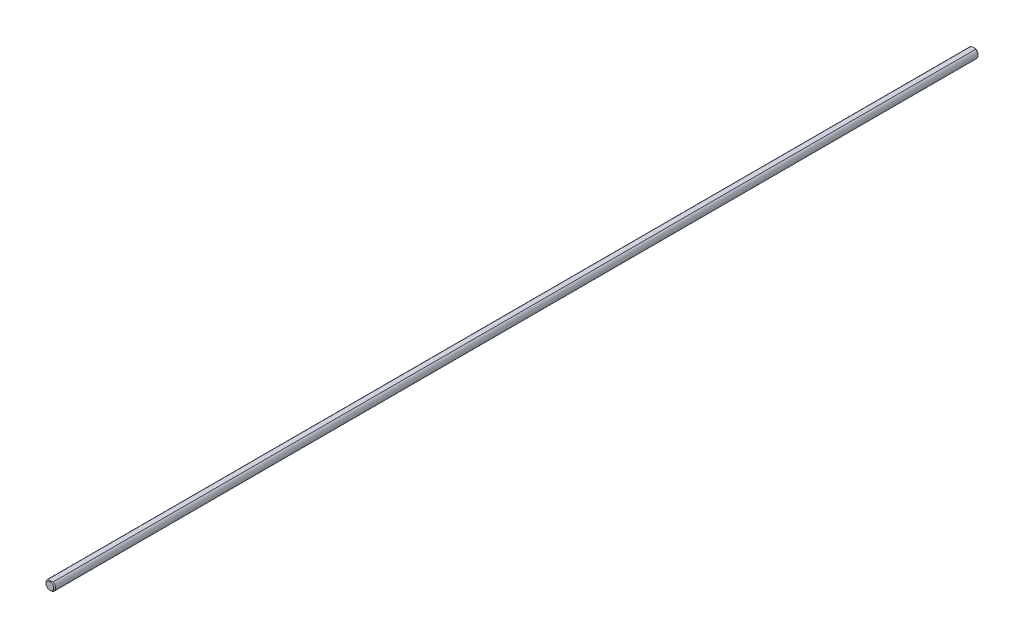
ISO-10303-21;
HEADER;
FILE_DESCRIPTION(('STEP AP214'),'2;1');
FILE_NAME('part.step','',(''),(''),'','','');
FILE_SCHEMA(('AUTOMOTIVE_DESIGN { 1 0 10303 214 1 1 1 1 }'));
ENDSEC;
DATA;
#1=APPLICATION_CONTEXT('core data for automotive mechanical design processes');
#2=APPLICATION_PROTOCOL_DEFINITION('international standard','automotive_design',2000,#1);
#3=PRODUCT_CONTEXT('',#1,'mechanical');
#4=PRODUCT('Part','Part','',(#3));
#5=PRODUCT_RELATED_PRODUCT_CATEGORY('part','',(#4));
#6=PRODUCT_DEFINITION_FORMATION('','',#4);
#7=PRODUCT_DEFINITION_CONTEXT('part definition',#1,'design');
#8=PRODUCT_DEFINITION('design','',#6,#7);
#9=PRODUCT_DEFINITION_SHAPE('','',#8);
#10=(LENGTH_UNIT() NAMED_UNIT(*) SI_UNIT(.MILLI.,.METRE.));
#11=(NAMED_UNIT(*) PLANE_ANGLE_UNIT() SI_UNIT($,.RADIAN.));
#12=(NAMED_UNIT(*) SI_UNIT($,.STERADIAN.) SOLID_ANGLE_UNIT());
#13=UNCERTAINTY_MEASURE_WITH_UNIT(LENGTH_MEASURE(1.E-05),#10,'distance_accuracy_value','');
#14=(GEOMETRIC_REPRESENTATION_CONTEXT(3) GLOBAL_UNCERTAINTY_ASSIGNED_CONTEXT((#13)) GLOBAL_UNIT_ASSIGNED_CONTEXT((#10,
#11,#12)) REPRESENTATION_CONTEXT('',''));
#15=CARTESIAN_POINT('',(0.,0.,0.));
#16=DIRECTION('',(0.,0.,1.));
#17=DIRECTION('',(1.,0.,0.));
#18=AXIS2_PLACEMENT_3D('',#15,#16,#17);
#19=CARTESIAN_POINT('',(0.,0.,304.8));
#20=DIRECTION('',(0.,0.,-1.));
#21=DIRECTION('',(-1.,0.,0.));
#22=AXIS2_PLACEMENT_3D('',#19,#20,#21);
#23=CYLINDRICAL_SURFACE('',#22,3.175);
#24=CARTESIAN_POINT('',(0.,0.,304.165));
#25=DIRECTION('',(0.,0.,1.));
#26=DIRECTION('',(1.,0.,0.));
#27=AXIS2_PLACEMENT_3D('',#24,#25,#26);
#28=CIRCLE('',#27,3.175);
#29=CARTESIAN_POINT('',(1.5875,2.74963065701559,304.165));
#30=VERTEX_POINT('',#29);
#31=CARTESIAN_POINT('',(-1.5875,2.74963065701559,304.165));
#32=VERTEX_POINT('',#31);
#33=EDGE_CURVE('E72',#30,#32,#28,.F.);
#34=ORIENTED_EDGE('',*,*,#33,.T.);
#35=DIRECTION('',(0.,0.,1.));
#36=VECTOR('',#35,1.);
#37=CARTESIAN_POINT('',(-1.5875,2.74963065701559,-304.8));
#38=LINE('',#37,#36);
#39=CARTESIAN_POINT('',(-1.5875,2.74963065701559,-304.164999999999));
#40=VERTEX_POINT('',#39);
#41=EDGE_CURVE('E50',#40,#32,#38,.T.);
#42=ORIENTED_EDGE('',*,*,#41,.F.);
#43=CARTESIAN_POINT('',(0.,0.,-304.164999999999));
#44=DIRECTION('',(0.,0.,1.));
#45=DIRECTION('',(1.,0.,0.));
#46=AXIS2_PLACEMENT_3D('',#43,#44,#45);
#47=CIRCLE('',#46,3.175);
#48=CARTESIAN_POINT('',(1.5875,2.74963065701559,-304.164999999999));
#49=VERTEX_POINT('',#48);
#50=EDGE_CURVE('E71',#40,#49,#47,.T.);
#51=ORIENTED_EDGE('',*,*,#50,.T.);
#52=DIRECTION('',(0.,0.,1.));
#53=VECTOR('',#52,1.);
#54=CARTESIAN_POINT('',(1.5875,2.74963065701559,-304.8));
#55=LINE('',#54,#53);
#56=EDGE_CURVE('E60',#49,#30,#55,.T.);
#57=ORIENTED_EDGE('',*,*,#56,.T.);
#58=EDGE_LOOP('',(#34,#42,#51,#57));
#59=FACE_BOUND('',#58,.T.);
#60=ADVANCED_FACE('F31',(#59),#23,.T.);
#61=CARTESIAN_POINT('',(0.,0.,304.8));
#62=DIRECTION('',(0.,0.,1.));
#63=DIRECTION('',(1.,0.,0.));
#64=AXIS2_PLACEMENT_3D('',#61,#62,#63);
#65=PLANE('',#64);
#66=CARTESIAN_POINT('',(0.,0.,304.8));
#67=DIRECTION('',(0.,0.,1.));
#68=DIRECTION('',(1.,0.,0.));
#69=AXIS2_PLACEMENT_3D('',#66,#67,#68);
#70=CIRCLE('',#69,2.54000000000021);
#71=CARTESIAN_POINT('',(2.54000000000021,0.,304.8));
#72=VERTEX_POINT('',#71);
#73=EDGE_CURVE('E44',#72,#72,#70,.T.);
#74=ORIENTED_EDGE('',*,*,#73,.T.);
#75=EDGE_LOOP('',(#74));
#76=FACE_BOUND('',#75,.T.);
#77=ADVANCED_FACE('F82',(#76),#65,.T.);
#78=CARTESIAN_POINT('',(0.,0.,-304.8));
#79=DIRECTION('',(0.,0.,1.));
#80=DIRECTION('',(1.,0.,0.));
#81=AXIS2_PLACEMENT_3D('',#78,#79,#80);
#82=PLANE('',#81);
#83=CARTESIAN_POINT('',(0.,0.,-304.8));
#84=DIRECTION('',(0.,0.,1.));
#85=DIRECTION('',(1.,0.,0.));
#86=AXIS2_PLACEMENT_3D('',#83,#84,#85);
#87=CIRCLE('',#86,2.53999999999938);
#88=CARTESIAN_POINT('',(2.53999999999938,0.,-304.8));
#89=VERTEX_POINT('',#88);
#90=EDGE_CURVE('E74',#89,#89,#87,.F.);
#91=ORIENTED_EDGE('',*,*,#90,.T.);
#92=EDGE_LOOP('',(#91));
#93=FACE_BOUND('',#92,.T.);
#94=ADVANCED_FACE('F90',(#93),#82,.F.);
#95=CARTESIAN_POINT('',(0.,0.,-304.164999999999));
#96=DIRECTION('',(0.,0.,1.));
#97=DIRECTION('',(1.,0.,0.));
#98=AXIS2_PLACEMENT_3D('',#95,#96,#97);
#99=CONICAL_SURFACE('',#98,3.175,0.785398163397463);
#100=CARTESIAN_POINT('',(-3.22896135223709,2.74963065701559,-303.098931718983));
#101=CARTESIAN_POINT('',(-3.15061649550086,2.74963065701559,-303.158566524546));
#102=CARTESIAN_POINT('',(-3.07184009651245,2.74963065701559,-303.217643482025));
#103=CARTESIAN_POINT('',(-2.91325130568802,2.74963065701559,-303.334429717618));
#104=CARTESIAN_POINT('',(-2.83343866506278,2.74963065701559,-303.392138657525));
#105=CARTESIAN_POINT('',(-2.6720206285273,2.74963065701559,-303.506347547805));
#106=CARTESIAN_POINT('',(-2.59040613970413,2.74963065701559,-303.562834689537));
#107=CARTESIAN_POINT('',(-2.42580311622148,2.74963065701559,-303.673763514334));
#108=CARTESIAN_POINT('',(-2.34281467809318,2.74963065701559,-303.728205340228));
#109=CARTESIAN_POINT('',(-2.17021447787212,2.74963065701559,-303.837773871165));
#110=CARTESIAN_POINT('',(-2.08050398524177,2.74963065701559,-303.89274583534));
#111=CARTESIAN_POINT('',(-1.89900904678676,2.74963065701559,-303.999146993197));
#112=CARTESIAN_POINT('',(-1.80722487525619,2.74963065701559,-304.050576651834));
#113=CARTESIAN_POINT('',(-1.62153760368914,2.74963065701559,-304.148814805051));
#114=CARTESIAN_POINT('',(-1.52764140922479,2.74963065701559,-304.195636250176));
#115=CARTESIAN_POINT('',(-1.33724706572087,2.74963065701559,-304.28360081534));
#116=CARTESIAN_POINT('',(-1.24075014112695,2.74963065701559,-304.324746553594));
#117=CARTESIAN_POINT('',(-1.05364742760737,2.74963065701559,-304.39655643723));
#118=CARTESIAN_POINT('',(-0.963276425588533,2.74963065701559,-304.427826043973));
#119=CARTESIAN_POINT('',(-0.780303735161007,2.74963065701559,-304.48312318735));
#120=CARTESIAN_POINT('',(-0.687701898779367,2.74963065701559,-304.507150242144));
#121=CARTESIAN_POINT('',(-0.502391431282764,2.74963065701559,-304.54628829084));
#122=CARTESIAN_POINT('',(-0.409716445146673,2.74963065701559,-304.561555954748));
#123=CARTESIAN_POINT('',(-0.223306330685189,2.74963065701559,-304.582868842029));
#124=CARTESIAN_POINT('',(-0.12957140343729,2.74963065701559,-304.588915786014));
#125=CARTESIAN_POINT('',(0.0543357559017518,2.74963065701559,-304.591309485248));
#126=CARTESIAN_POINT('',(0.144503242552437,2.74963065701559,-304.588028086227));
#127=CARTESIAN_POINT('',(0.32409554357348,2.74963065701559,-304.572781771963));
#128=CARTESIAN_POINT('',(0.413520286896936,2.74963065701559,-304.560816035481));
#129=CARTESIAN_POINT('',(0.592496066024135,2.74963065701559,-304.528661523536));
#130=CARTESIAN_POINT('',(0.682021177379072,2.74963065701559,-304.508330580175));
#131=CARTESIAN_POINT('',(0.859103373963872,2.74963065701559,-304.460545197953));
#132=CARTESIAN_POINT('',(0.946660601088835,2.74963065701559,-304.433091274501));
#133=CARTESIAN_POINT('',(1.2195462268047,2.74963065701559,-304.337129482189));
#134=CARTESIAN_POINT('',(1.40108594012674,2.74963065701559,-304.257809452736));
#135=CARTESIAN_POINT('',(1.6667588948987,2.74963065701559,-304.125553985225));
#136=CARTESIAN_POINT('',(1.75437488385029,2.74963065701559,-304.079152661123));
#137=CARTESIAN_POINT('',(1.92761951465614,2.74963065701559,-303.982769237767));
#138=CARTESIAN_POINT('',(2.0132485070547,2.74963065701559,-303.932787776575));
#139=CARTESIAN_POINT('',(2.17855184285751,2.74963065701559,-303.832513843305));
#140=CARTESIAN_POINT('',(2.25831097248817,2.74963065701559,-303.782359559039));
#141=CARTESIAN_POINT('',(2.41646118640015,2.74963065701559,-303.679928217762));
#142=CARTESIAN_POINT('',(2.49485216688197,2.74963065701559,-303.62765100068));
#143=CARTESIAN_POINT('',(2.64980987258649,2.74963065701559,-303.521783125055));
#144=CARTESIAN_POINT('',(2.72638621983979,2.74963065701559,-303.468206491773));
#145=CARTESIAN_POINT('',(2.87849044969187,2.74963065701559,-303.359627090016));
#146=CARTESIAN_POINT('',(2.95401861519283,2.74963065701559,-303.304624718308));
#147=CARTESIAN_POINT('',(3.02910770969646,2.74963065701559,-303.249038955582));
#148=B_SPLINE_CURVE_WITH_KNOTS('',3,(#100,#101,#102,#103,#104,#105,#106,#107,#108,#109,#110,
#111,#112,#113,#114,#115,#116,#117,#118,#119,#120,#121,#122,#123,#124,#125,#126,#127,#128,#129,
#130,#131,#132,#133,#134,#135,#136,#137,#138,#139,#140,#141,#142,#143,#144,#145,#146,#147),
.UNSPECIFIED.,.F.,.F.,(4,2,2,2,2,2,2,2,2,2,2,2,2,2,2,2,2,2,2,2,2,2,2,4),(0.,0.295383449271152,
0.590839178498704,0.888580871622888,1.18630173399061,1.50187785569747,1.81741247644337,
2.13203338294808,2.44650866534161,2.73314264689616,3.01979569373813,3.30114758261603,
3.58244696402005,3.85269226293472,4.12296312107165,4.39803055604375,4.67307809311847,
5.26557071241292,5.56297998480367,5.86033638333453,6.14295523590868,6.42559543796915,
6.70595195130109,6.98623126477261),.UNSPECIFIED.);
#149=EDGE_CURVE('E55',#49,#40,#148,.F.);
#150=ORIENTED_EDGE('',*,*,#149,.F.);
#151=ORIENTED_EDGE('',*,*,#50,.F.);
#152=EDGE_LOOP('',(#150,#151));
#153=FACE_BOUND('',#152,.T.);
#154=ORIENTED_EDGE('',*,*,#90,.F.);
#155=EDGE_LOOP('',(#154));
#156=FACE_BOUND('',#155,.T.);
#157=ADVANCED_FACE('F69',(#153,#156),#99,.T.);
#158=CARTESIAN_POINT('',(0.,0.,304.8));
#159=DIRECTION('',(0.,0.,-1.));
#160=DIRECTION('',(-1.,0.,0.));
#161=AXIS2_PLACEMENT_3D('',#158,#159,#160);
#162=CONICAL_SURFACE('',#161,2.54000000000021,0.785398163397419);
#163=CARTESIAN_POINT('',(-3.22896135223727,2.74963065701559,303.098931718984));
#164=CARTESIAN_POINT('',(-3.15061649550104,2.74963065701559,303.158566524546));
#165=CARTESIAN_POINT('',(-3.07184009651264,2.74963065701559,303.217643482025));
#166=CARTESIAN_POINT('',(-2.91325130568818,2.74963065701559,303.334429717618));
#167=CARTESIAN_POINT('',(-2.83343866506293,2.74963065701559,303.392138657526));
#168=CARTESIAN_POINT('',(-2.67202062852744,2.74963065701559,303.506347547805));
#169=CARTESIAN_POINT('',(-2.59040613970426,2.74963065701559,303.562834689537));
#170=CARTESIAN_POINT('',(-2.42580311622162,2.74963065701559,303.673763514335));
#171=CARTESIAN_POINT('',(-2.34281467809333,2.74963065701559,303.728205340229));
#172=CARTESIAN_POINT('',(-2.17021447787229,2.74963065701559,303.837773871166));
#173=CARTESIAN_POINT('',(-2.08050398524193,2.74963065701559,303.89274583534));
#174=CARTESIAN_POINT('',(-1.89900904678691,2.74963065701559,303.999146993198));
#175=CARTESIAN_POINT('',(-1.80722487525635,2.74963065701559,304.050576651835));
#176=CARTESIAN_POINT('',(-1.62153760368929,2.74963065701559,304.148814805052));
#177=CARTESIAN_POINT('',(-1.52764140922493,2.74963065701559,304.195636250177));
#178=CARTESIAN_POINT('',(-1.33724706572099,2.74963065701559,304.283600815341));
#179=CARTESIAN_POINT('',(-1.24075014112708,2.74963065701559,304.324746553594));
#180=CARTESIAN_POINT('',(-1.0536474276075,2.74963065701559,304.396556437231));
#181=CARTESIAN_POINT('',(-0.963276425588667,2.74963065701559,304.427826043973));
#182=CARTESIAN_POINT('',(-0.780303735161142,2.74963065701559,304.483123187351));
#183=CARTESIAN_POINT('',(-0.687701898779501,2.74963065701559,304.507150242145));
#184=CARTESIAN_POINT('',(-0.502391431282896,2.74963065701559,304.546288290841));
#185=CARTESIAN_POINT('',(-0.409716445146804,2.74963065701559,304.561555954749));
#186=CARTESIAN_POINT('',(-0.223306330685325,2.74963065701559,304.58286884203));
#187=CARTESIAN_POINT('',(-0.129571403437432,2.74963065701559,304.588915786014));
#188=CARTESIAN_POINT('',(0.0543357559016028,2.74963065701559,304.591309485249));
#189=CARTESIAN_POINT('',(0.144503242552287,2.74963065701559,304.588028086228));
#190=CARTESIAN_POINT('',(0.324095543573328,2.74963065701559,304.572781771964));
#191=CARTESIAN_POINT('',(0.413520286896783,2.74963065701559,304.560816035482));
#192=CARTESIAN_POINT('',(0.592496066023981,2.74963065701559,304.528661523536));
#193=CARTESIAN_POINT('',(0.682021177378918,2.74963065701559,304.508330580175));
#194=CARTESIAN_POINT('',(0.859103373963716,2.74963065701559,304.460545197954));
#195=CARTESIAN_POINT('',(0.946660601088676,2.74963065701559,304.433091274501));
#196=CARTESIAN_POINT('',(1.2195462268045,2.74963065701559,304.33712948219));
#197=CARTESIAN_POINT('',(1.4010859401265,2.74963065701559,304.257809452737));
#198=CARTESIAN_POINT('',(1.6667588948984,2.74963065701559,304.125553985226));
#199=CARTESIAN_POINT('',(1.75437488384997,2.74963065701559,304.079152661124));
#200=CARTESIAN_POINT('',(1.92761951465579,2.74963065701559,303.982769237768));
#201=CARTESIAN_POINT('',(2.01324850705433,2.74963065701559,303.932787776576));
#202=CARTESIAN_POINT('',(2.17855184285708,2.74963065701559,303.832513843306));
#203=CARTESIAN_POINT('',(2.25831097248769,2.74963065701559,303.78235955904));
#204=CARTESIAN_POINT('',(2.41646118639962,2.74963065701559,303.679928217763));
#205=CARTESIAN_POINT('',(2.49485216688142,2.74963065701559,303.627651000681));
#206=CARTESIAN_POINT('',(2.64980987258591,2.74963065701559,303.521783125056));
#207=CARTESIAN_POINT('',(2.7263862198392,2.74963065701559,303.468206491774));
#208=CARTESIAN_POINT('',(2.87849044969126,2.74963065701559,303.359627090017));
#209=CARTESIAN_POINT('',(2.95401861519219,2.74963065701559,303.304624718309));
#210=CARTESIAN_POINT('',(3.02910770969582,2.74963065701559,303.249038955583));
#211=B_SPLINE_CURVE_WITH_KNOTS('',3,(#163,#164,#165,#166,#167,#168,#169,#170,#171,#172,#173,
#174,#175,#176,#177,#178,#179,#180,#181,#182,#183,#184,#185,#186,#187,#188,#189,#190,#191,#192,
#193,#194,#195,#196,#197,#198,#199,#200,#201,#202,#203,#204,#205,#206,#207,#208,#209,#210),
.UNSPECIFIED.,.F.,.F.,(4,2,2,2,2,2,2,2,2,2,2,2,2,2,2,2,2,2,2,2,2,2,2,4),(0.,0.295383449271194,
0.590839178498768,0.88858087162296,1.1863017339907,1.50187785569752,1.81741247644345,
2.13203338294822,2.44650866534174,2.73314264689631,3.01979569373827,3.30114758261618,
3.58244696402018,3.85269226293485,4.12296312107178,4.39803055604387,4.6730780931186,
5.26557071241291,5.56297998480358,5.86033638333436,6.14295523590839,6.42559543796878,
6.7059519513007,6.98623126477215),.UNSPECIFIED.);
#212=EDGE_CURVE('E11',#32,#30,#211,.T.);
#213=ORIENTED_EDGE('',*,*,#212,.F.);
#214=ORIENTED_EDGE('',*,*,#33,.F.);
#215=EDGE_LOOP('',(#213,#214));
#216=FACE_BOUND('',#215,.T.);
#217=ORIENTED_EDGE('',*,*,#73,.F.);
#218=EDGE_LOOP('',(#217));
#219=FACE_BOUND('',#218,.T.);
#220=ADVANCED_FACE('F33',(#216,#219),#162,.T.);
#221=CARTESIAN_POINT('',(-1.5875,2.74963065701559,-304.8));
#222=DIRECTION('',(0.,-1.,0.));
#223=DIRECTION('',(0.,0.,-1.));
#224=AXIS2_PLACEMENT_3D('',#221,#222,#223);
#225=PLANE('',#224);
#226=ORIENTED_EDGE('',*,*,#149,.T.);
#227=ORIENTED_EDGE('',*,*,#41,.T.);
#228=ORIENTED_EDGE('',*,*,#212,.T.);
#229=ORIENTED_EDGE('',*,*,#56,.F.);
#230=EDGE_LOOP('',(#226,#227,#228,#229));
#231=FACE_BOUND('',#230,.T.);
#232=ADVANCED_FACE('F61',(#231),#225,.F.);
#233=CLOSED_SHELL('',(#60,#77,#94,#157,#220,#232));
#234=MANIFOLD_SOLID_BREP('B2',#233);
#235=ADVANCED_BREP_SHAPE_REPRESENTATION('',(#18,#234),#14);
#236=SHAPE_DEFINITION_REPRESENTATION(#9,#235);
ENDSEC;
END-ISO-10303-21;
